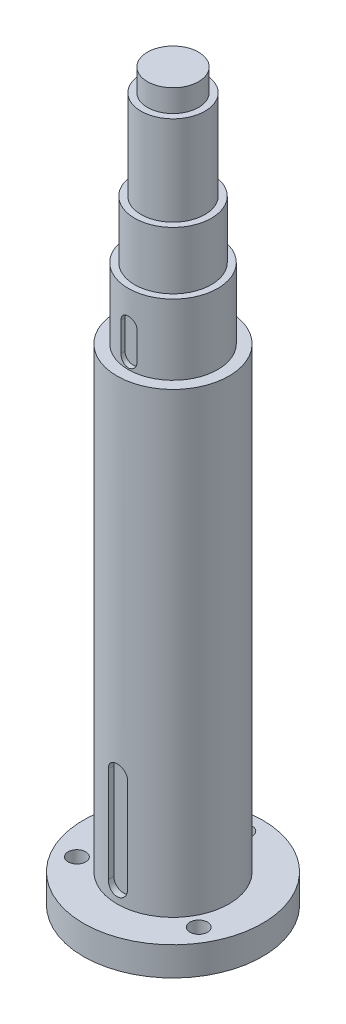
ISO-10303-21;
HEADER;
FILE_DESCRIPTION(('STEP AP214'),'2;1');
FILE_NAME('part.step','',(''),(''),'','','');
FILE_SCHEMA(('AUTOMOTIVE_DESIGN { 1 0 10303 214 1 1 1 1 }'));
ENDSEC;
DATA;
#1=APPLICATION_CONTEXT('core data for automotive mechanical design processes');
#2=APPLICATION_PROTOCOL_DEFINITION('international standard','automotive_design',2000,#1);
#3=PRODUCT_CONTEXT('',#1,'mechanical');
#4=PRODUCT('Part','Part','',(#3));
#5=PRODUCT_RELATED_PRODUCT_CATEGORY('part','',(#4));
#6=PRODUCT_DEFINITION_FORMATION('','',#4);
#7=PRODUCT_DEFINITION_CONTEXT('part definition',#1,'design');
#8=PRODUCT_DEFINITION('design','',#6,#7);
#9=PRODUCT_DEFINITION_SHAPE('','',#8);
#10=(LENGTH_UNIT() NAMED_UNIT(*) SI_UNIT(.MILLI.,.METRE.));
#11=(NAMED_UNIT(*) PLANE_ANGLE_UNIT() SI_UNIT($,.RADIAN.));
#12=(NAMED_UNIT(*) SI_UNIT($,.STERADIAN.) SOLID_ANGLE_UNIT());
#13=UNCERTAINTY_MEASURE_WITH_UNIT(LENGTH_MEASURE(1.E-05),#10,'distance_accuracy_value','');
#14=(GEOMETRIC_REPRESENTATION_CONTEXT(3) GLOBAL_UNCERTAINTY_ASSIGNED_CONTEXT((#13)) GLOBAL_UNIT_ASSIGNED_CONTEXT((#10,
#11,#12)) REPRESENTATION_CONTEXT('',''));
#15=CARTESIAN_POINT('',(0.,0.,0.));
#16=DIRECTION('',(0.,0.,1.));
#17=DIRECTION('',(1.,0.,0.));
#18=AXIS2_PLACEMENT_3D('',#15,#16,#17);
#19=CARTESIAN_POINT('',(19.0525588832577,227.001,10.9999999999998));
#20=DIRECTION('',(0.,-1.,0.));
#21=DIRECTION('',(0.,0.,-1.));
#22=AXIS2_PLACEMENT_3D('',#19,#20,#21);
#23=CYLINDRICAL_SURFACE('',#22,2.75);
#24=CARTESIAN_POINT('',(19.0525588832577,9.00000000000001,10.9999999999998));
#25=DIRECTION('',(0.,-1.,0.));
#26=DIRECTION('',(0.,0.,-1.));
#27=AXIS2_PLACEMENT_3D('',#24,#25,#26);
#28=CIRCLE('',#27,2.75);
#29=CARTESIAN_POINT('',(19.0525588832577,9.00000000000001,8.24999999999982));
#30=VERTEX_POINT('',#29);
#31=EDGE_CURVE('E368',#30,#30,#28,.F.);
#32=ORIENTED_EDGE('',*,*,#31,.T.);
#33=EDGE_LOOP('',(#32));
#34=FACE_BOUND('',#33,.T.);
#35=CARTESIAN_POINT('',(19.0525588832577,5.,10.9999999999998));
#36=DIRECTION('',(0.,-1.,0.));
#37=DIRECTION('',(0.,0.,-1.));
#38=AXIS2_PLACEMENT_3D('',#35,#36,#37);
#39=CIRCLE('',#38,2.75);
#40=CARTESIAN_POINT('',(19.0525588832577,5.,8.24999999999982));
#41=VERTEX_POINT('',#40);
#42=EDGE_CURVE('E38',#41,#41,#39,.F.);
#43=ORIENTED_EDGE('',*,*,#42,.F.);
#44=EDGE_LOOP('',(#43));
#45=FACE_BOUND('',#44,.T.);
#46=ADVANCED_FACE('F34',(#34,#45),#23,.F.);
#47=CARTESIAN_POINT('',(-19.0525588832576,227.001,11.0000000000001));
#48=DIRECTION('',(0.,-1.,0.));
#49=DIRECTION('',(0.,0.,-1.));
#50=AXIS2_PLACEMENT_3D('',#47,#48,#49);
#51=CYLINDRICAL_SURFACE('',#50,2.75);
#52=CARTESIAN_POINT('',(-19.0525588832576,9.00000000000001,11.0000000000001));
#53=DIRECTION('',(0.,-1.,0.));
#54=DIRECTION('',(0.,0.,-1.));
#55=AXIS2_PLACEMENT_3D('',#52,#53,#54);
#56=CIRCLE('',#55,2.75);
#57=CARTESIAN_POINT('',(-19.0525588832576,9.00000000000001,8.25000000000009));
#58=VERTEX_POINT('',#57);
#59=EDGE_CURVE('E364',#58,#58,#56,.F.);
#60=ORIENTED_EDGE('',*,*,#59,.T.);
#61=EDGE_LOOP('',(#60));
#62=FACE_BOUND('',#61,.T.);
#63=CARTESIAN_POINT('',(-19.0525588832576,5.,11.0000000000001));
#64=DIRECTION('',(0.,-1.,0.));
#65=DIRECTION('',(0.,0.,-1.));
#66=AXIS2_PLACEMENT_3D('',#63,#64,#65);
#67=CIRCLE('',#66,2.75);
#68=CARTESIAN_POINT('',(-19.0525588832576,5.,8.25000000000009));
#69=VERTEX_POINT('',#68);
#70=EDGE_CURVE('E372',#69,#69,#67,.F.);
#71=ORIENTED_EDGE('',*,*,#70,.F.);
#72=EDGE_LOOP('',(#71));
#73=FACE_BOUND('',#72,.T.);
#74=ADVANCED_FACE('F285',(#62,#73),#51,.F.);
#75=CARTESIAN_POINT('',(0.,227.001,-22.));
#76=DIRECTION('',(0.,-1.,0.));
#77=DIRECTION('',(0.,0.,-1.));
#78=AXIS2_PLACEMENT_3D('',#75,#76,#77);
#79=CYLINDRICAL_SURFACE('',#78,2.75);
#80=CARTESIAN_POINT('',(0.,9.00000000000001,-22.));
#81=DIRECTION('',(0.,-1.,0.));
#82=DIRECTION('',(0.,0.,-1.));
#83=AXIS2_PLACEMENT_3D('',#80,#81,#82);
#84=CIRCLE('',#83,2.75);
#85=CARTESIAN_POINT('',(0.,9.00000000000001,-24.75));
#86=VERTEX_POINT('',#85);
#87=EDGE_CURVE('E123',#86,#86,#84,.F.);
#88=ORIENTED_EDGE('',*,*,#87,.T.);
#89=EDGE_LOOP('',(#88));
#90=FACE_BOUND('',#89,.T.);
#91=CARTESIAN_POINT('',(0.,5.,-22.));
#92=DIRECTION('',(0.,-1.,0.));
#93=DIRECTION('',(0.,0.,-1.));
#94=AXIS2_PLACEMENT_3D('',#91,#92,#93);
#95=CIRCLE('',#94,2.75);
#96=CARTESIAN_POINT('',(0.,5.,-24.75));
#97=VERTEX_POINT('',#96);
#98=EDGE_CURVE('E126',#97,#97,#95,.F.);
#99=ORIENTED_EDGE('',*,*,#98,.F.);
#100=EDGE_LOOP('',(#99));
#101=FACE_BOUND('',#100,.T.);
#102=ADVANCED_FACE('F291',(#90,#101),#79,.F.);
#103=CARTESIAN_POINT('',(0.,0.,0.));
#104=DIRECTION('',(0.,1.,0.));
#105=DIRECTION('',(0.,0.,1.));
#106=AXIS2_PLACEMENT_3D('',#103,#104,#105);
#107=PLANE('',#106);
#108=CARTESIAN_POINT('',(19.0525588832577,0.,10.9999999999998));
#109=DIRECTION('',(0.,-1.,0.));
#110=DIRECTION('',(0.866025403784443,0.,0.499999999999992));
#111=AXIS2_PLACEMENT_3D('',#108,#109,#110);
#112=CIRCLE('',#111,4.5);
#113=CARTESIAN_POINT('',(22.9496732002877,0.,13.2499999999998));
#114=VERTEX_POINT('',#113);
#115=EDGE_CURVE('E354',#114,#114,#112,.T.);
#116=ORIENTED_EDGE('',*,*,#115,.F.);
#117=EDGE_LOOP('',(#116));
#118=FACE_BOUND('',#117,.T.);
#119=CARTESIAN_POINT('',(-19.0525588832576,0.,11.0000000000001));
#120=DIRECTION('',(0.,-1.,0.));
#121=DIRECTION('',(-0.866025403784436,0.,0.500000000000004));
#122=AXIS2_PLACEMENT_3D('',#119,#120,#121);
#123=CIRCLE('',#122,4.5);
#124=CARTESIAN_POINT('',(-22.9496732002876,0.,13.2500000000001));
#125=VERTEX_POINT('',#124);
#126=EDGE_CURVE('E358',#125,#125,#123,.T.);
#127=ORIENTED_EDGE('',*,*,#126,.F.);
#128=EDGE_LOOP('',(#127));
#129=FACE_BOUND('',#128,.T.);
#130=CARTESIAN_POINT('',(0.,0.,-22.));
#131=DIRECTION('',(0.,-1.,0.));
#132=DIRECTION('',(0.,0.,-1.));
#133=AXIS2_PLACEMENT_3D('',#130,#131,#132);
#134=CIRCLE('',#133,4.5);
#135=CARTESIAN_POINT('',(0.,0.,-26.5));
#136=VERTEX_POINT('',#135);
#137=EDGE_CURVE('E361',#136,#136,#134,.T.);
#138=ORIENTED_EDGE('',*,*,#137,.F.);
#139=EDGE_LOOP('',(#138));
#140=FACE_BOUND('',#139,.T.);
#141=CARTESIAN_POINT('',(0.,0.,0.));
#142=DIRECTION('',(0.,1.,0.));
#143=DIRECTION('',(0.,0.,1.));
#144=AXIS2_PLACEMENT_3D('',#141,#142,#143);
#145=CIRCLE('',#144,28.);
#146=CARTESIAN_POINT('',(0.,0.,28.));
#147=VERTEX_POINT('',#146);
#148=EDGE_CURVE('E193',#147,#147,#145,.T.);
#149=ORIENTED_EDGE('',*,*,#148,.F.);
#150=EDGE_LOOP('',(#149));
#151=FACE_BOUND('',#150,.T.);
#152=ADVANCED_FACE('F36',(#118,#129,#140,#151),#107,.F.);
#153=CARTESIAN_POINT('',(0.,340.077659461417,0.));
#154=DIRECTION('',(0.,1.,0.));
#155=DIRECTION('',(0.,0.,1.));
#156=AXIS2_PLACEMENT_3D('',#153,#154,#155);
#157=CYLINDRICAL_SURFACE('',#156,28.);
#158=CARTESIAN_POINT('',(0.,9.00000000000001,0.));
#159=DIRECTION('',(0.,1.,0.));
#160=DIRECTION('',(0.,0.,1.));
#161=AXIS2_PLACEMENT_3D('',#158,#159,#160);
#162=CIRCLE('',#161,28.);
#163=CARTESIAN_POINT('',(0.,9.00000000000001,28.));
#164=VERTEX_POINT('',#163);
#165=EDGE_CURVE('E190',#164,#164,#162,.T.);
#166=ORIENTED_EDGE('',*,*,#165,.F.);
#167=EDGE_LOOP('',(#166));
#168=FACE_BOUND('',#167,.T.);
#169=ORIENTED_EDGE('',*,*,#148,.T.);
#170=EDGE_LOOP('',(#169));
#171=FACE_BOUND('',#170,.T.);
#172=ADVANCED_FACE('F339',(#168,#171),#157,.T.);
#173=CARTESIAN_POINT('',(28.,9.,0.));
#174=DIRECTION('',(0.,-1.,0.));
#175=DIRECTION('',(0.,0.,-1.));
#176=AXIS2_PLACEMENT_3D('',#173,#174,#175);
#177=PLANE('',#176);
#178=ORIENTED_EDGE('',*,*,#31,.F.);
#179=EDGE_LOOP('',(#178));
#180=FACE_BOUND('',#179,.T.);
#181=ORIENTED_EDGE('',*,*,#59,.F.);
#182=EDGE_LOOP('',(#181));
#183=FACE_BOUND('',#182,.T.);
#184=ORIENTED_EDGE('',*,*,#87,.F.);
#185=EDGE_LOOP('',(#184));
#186=FACE_BOUND('',#185,.T.);
#187=CARTESIAN_POINT('',(0.,9.00000000000001,0.));
#188=DIRECTION('',(0.,1.,0.));
#189=DIRECTION('',(0.,0.,1.));
#190=AXIS2_PLACEMENT_3D('',#187,#188,#189);
#191=CIRCLE('',#190,17.5);
#192=CARTESIAN_POINT('',(0.,9.00000000000001,17.5));
#193=VERTEX_POINT('',#192);
#194=EDGE_CURVE('E187',#193,#193,#191,.T.);
#195=ORIENTED_EDGE('',*,*,#194,.F.);
#196=EDGE_LOOP('',(#195));
#197=FACE_BOUND('',#196,.T.);
#198=ORIENTED_EDGE('',*,*,#165,.T.);
#199=EDGE_LOOP('',(#198));
#200=FACE_BOUND('',#199,.T.);
#201=ADVANCED_FACE('F332',(#180,#183,#186,#197,#200),#177,.F.);
#202=CARTESIAN_POINT('',(0.,340.077659461417,0.));
#203=DIRECTION('',(0.,1.,0.));
#204=DIRECTION('',(0.,0.,1.));
#205=AXIS2_PLACEMENT_3D('',#202,#203,#204);
#206=CYLINDRICAL_SURFACE('',#205,17.5);
#207=DIRECTION('',(0.,1.,0.));
#208=VECTOR('',#207,1.);
#209=CARTESIAN_POINT('',(2.99999999999996,340.077659461417,17.2409396495667));
#210=LINE('',#209,#208);
#211=CARTESIAN_POINT('',(3.,44.,17.2409396495667));
#212=VERTEX_POINT('',#211);
#213=CARTESIAN_POINT('',(3.,14.,17.2409396495667));
#214=VERTEX_POINT('',#213);
#215=EDGE_CURVE('E325',#212,#214,#210,.F.);
#216=ORIENTED_EDGE('',*,*,#215,.T.);
#217=CARTESIAN_POINT('',(3.,14.,17.2409396495667));
#218=CARTESIAN_POINT('',(3.0000088040537,13.9162831483448,17.240933522875));
#219=CARTESIAN_POINT('',(2.99649582804046,13.8325709851479,17.2415492732181));
#220=CARTESIAN_POINT('',(2.98249456452798,13.6657579190101,17.2439791973893));
#221=CARTESIAN_POINT('',(2.97200699674828,13.5826569538933,17.2457932475627));
#222=CARTESIAN_POINT('',(2.94414295173168,13.4177582332087,17.2505713408137));
#223=CARTESIAN_POINT('',(2.92677547561188,13.3359589195389,17.2535338811914));
#224=CARTESIAN_POINT('',(2.88530199450964,13.1741566952482,17.2605176845743));
#225=CARTESIAN_POINT('',(2.86119599181698,13.0941537840168,17.2645389472196));
#226=CARTESIAN_POINT('',(2.77899783708822,12.8576492292287,17.2780294463356));
#227=CARTESIAN_POINT('',(2.71100609527454,12.704537516206,17.2889289407825));
#228=CARTESIAN_POINT('',(2.55069376365582,12.4119724808913,17.3133038570054));
#229=CARTESIAN_POINT('',(2.45837256556576,12.2725195002144,17.326779343184));
#230=CARTESIAN_POINT('',(2.25098410381963,12.0096905954682,17.3549443765962));
#231=CARTESIAN_POINT('',(2.13571500938206,11.8864747212079,17.3696439701141));
#232=CARTESIAN_POINT('',(1.88613300564843,11.6610272667778,17.3985129918921));
#233=CARTESIAN_POINT('',(1.75181717893938,11.5587989071757,17.4126823385127));
#234=CARTESIAN_POINT('',(1.46690914941874,11.3776250961241,17.4390005653397));
#235=CARTESIAN_POINT('',(1.31621959902381,11.2988306159742,17.4511361335045));
#236=CARTESIAN_POINT('',(1.00350915711504,11.1677383960012,17.4719058089544));
#237=CARTESIAN_POINT('',(0.841489687717146,11.1154373375293,17.4805403547613));
#238=CARTESIAN_POINT('',(0.512384825162235,11.039305906677,17.4932645087899));
#239=CARTESIAN_POINT('',(0.345364126893581,11.0152032502798,17.4973975561921));
#240=CARTESIAN_POINT('',(0.00959767163450528,10.9953057761956,17.5008024278457));
#241=CARTESIAN_POINT('',(-0.159148002024918,10.999509597457,17.5000744858265));
#242=CARTESIAN_POINT('',(-0.49170276478881,11.0358951688302,17.4938735057628));
#243=CARTESIAN_POINT('',(-0.655545062925507,11.0677831074717,17.4884503002017));
#244=CARTESIAN_POINT('',(-0.975517346205458,11.1581684499129,17.473523834867));
#245=CARTESIAN_POINT('',(-1.13164713594127,11.2166665275356,17.4640204717758));
#246=CARTESIAN_POINT('',(-1.43263521316219,11.3589020091258,17.441916799726));
#247=CARTESIAN_POINT('',(-1.57743532822014,11.4427601256503,17.429301733358));
#248=CARTESIAN_POINT('',(-1.85101374510969,11.6332438394255,17.4023754724501));
#249=CARTESIAN_POINT('',(-1.97979126157134,11.7398705520155,17.3880641948351));
#250=CARTESIAN_POINT('',(-2.21939638987407,11.9744757576199,17.3591202396607));
#251=CARTESIAN_POINT('',(-2.3299750110891,12.1027084455725,17.3444857890986));
#252=CARTESIAN_POINT('',(-2.52811891278482,12.3760810488902,17.3167162017033));
#253=CARTESIAN_POINT('',(-2.61567766193135,12.5212257458091,17.3035814909819));
#254=CARTESIAN_POINT('',(-2.76535092265273,12.8246206169006,17.2802952650445));
#255=CARTESIAN_POINT('',(-2.82741926032348,12.9828939549107,17.2701491727941));
#256=CARTESIAN_POINT('',(-2.92393010715655,13.3077258419107,17.2540739223703));
#257=CARTESIAN_POINT('',(-2.95841389098171,13.474271614767,17.2481384653514));
#258=CARTESIAN_POINT('',(-2.98573965568073,13.7017439639912,17.2434157056549));
#259=CARTESIAN_POINT('',(-2.99108946982253,13.7613185145031,17.2424880383213));
#260=CARTESIAN_POINT('',(-2.99821500871414,13.8805866549158,17.2412506208778));
#261=CARTESIAN_POINT('',(-2.99999674326831,13.940279874851,17.2409398317527));
#262=CARTESIAN_POINT('',(-3.,14.,17.2409396495667));
#263=B_SPLINE_CURVE_WITH_KNOTS('',3,(#217,#218,#219,#220,#221,#222,#223,#224,#225,#226,#227,
#228,#229,#230,#231,#232,#233,#234,#235,#236,#237,#238,#239,#240,#241,#242,#243,#244,#245,#246,
#247,#248,#249,#250,#251,#252,#253,#254,#255,#256,#257,#258,#259,#260,#261,#262),.UNSPECIFIED.,
.F.,.F.,(4,2,2,2,2,2,2,2,2,2,2,2,2,2,2,2,2,2,2,2,2,2,4),(0.,0.251066363004867,0.502106822079304,
0.752819919097137,1.00353293092177,1.50461549636059,2.0057105910537,2.51142483323933,
3.01721662017684,3.52619966130844,4.03511892986121,4.53908241461735,5.04302166762933,
5.5416771043184,6.04034516868375,6.54142526197249,7.04252990673079,7.55000463252362,
8.05762318703839,8.56615724003014,9.07392894462736,9.25331063398997,9.4323899313747),.UNSPECIFIED.);
#264=CARTESIAN_POINT('',(-3.,14.,17.2409396495667));
#265=VERTEX_POINT('',#264);
#266=EDGE_CURVE('E196',#214,#265,#263,.T.);
#267=ORIENTED_EDGE('',*,*,#266,.T.);
#268=DIRECTION('',(0.,1.,0.));
#269=VECTOR('',#268,1.);
#270=CARTESIAN_POINT('',(-3.00000000000003,340.077659461417,17.2409396495667));
#271=LINE('',#270,#269);
#272=CARTESIAN_POINT('',(-3.00000000000003,44.,17.2409396495667));
#273=VERTEX_POINT('',#272);
#274=EDGE_CURVE('E327',#265,#273,#271,.T.);
#275=ORIENTED_EDGE('',*,*,#274,.T.);
#276=CARTESIAN_POINT('',(-3.,44.,17.2409396495667));
#277=CARTESIAN_POINT('',(-3.0000088040537,44.0837168516552,17.240933522875));
#278=CARTESIAN_POINT('',(-2.99649582804046,44.1674290148521,17.2415492732181));
#279=CARTESIAN_POINT('',(-2.98249456452797,44.3342420809899,17.2439791973893));
#280=CARTESIAN_POINT('',(-2.97200699674828,44.4173430461067,17.2457932475627));
#281=CARTESIAN_POINT('',(-2.94414295173167,44.5822417667913,17.2505713408137));
#282=CARTESIAN_POINT('',(-2.92677547561188,44.6640410804611,17.2535338811914));
#283=CARTESIAN_POINT('',(-2.88530199450964,44.8258433047518,17.2605176845743));
#284=CARTESIAN_POINT('',(-2.86119599181697,44.9058462159832,17.2645389472196));
#285=CARTESIAN_POINT('',(-2.77899783708822,45.1423507707714,17.2780294463356));
#286=CARTESIAN_POINT('',(-2.71100609527453,45.295462483794,17.2889289407825));
#287=CARTESIAN_POINT('',(-2.55069376365582,45.5880275191087,17.3133038570054));
#288=CARTESIAN_POINT('',(-2.45837256556576,45.7274804997856,17.326779343184));
#289=CARTESIAN_POINT('',(-2.25098410381962,45.9903094045318,17.3549443765962));
#290=CARTESIAN_POINT('',(-2.13571500938206,46.1135252787921,17.3696439701141));
#291=CARTESIAN_POINT('',(-1.88613300564842,46.3389727332222,17.3985129918921));
#292=CARTESIAN_POINT('',(-1.75181717893937,46.4412010928243,17.4126823385127));
#293=CARTESIAN_POINT('',(-1.46690914941873,46.6223749038759,17.4390005653397));
#294=CARTESIAN_POINT('',(-1.31621959902381,46.7011693840258,17.4511361335045));
#295=CARTESIAN_POINT('',(-1.00350915711504,46.8322616039989,17.4719058089544));
#296=CARTESIAN_POINT('',(-0.841489687717143,46.8845626624707,17.4805403547613));
#297=CARTESIAN_POINT('',(-0.512384825162232,46.960694093323,17.4932645087899));
#298=CARTESIAN_POINT('',(-0.345364126893578,46.9847967497202,17.4973975561921));
#299=CARTESIAN_POINT('',(-0.00959767163450268,47.0046942238045,17.5008024278457));
#300=CARTESIAN_POINT('',(0.15914800202492,47.000490402543,17.5000744858265));
#301=CARTESIAN_POINT('',(0.491702764788814,46.9641048311698,17.4938735057628));
#302=CARTESIAN_POINT('',(0.655545062925512,46.9322168925283,17.4884503002017));
#303=CARTESIAN_POINT('',(0.975517346205462,46.8418315500871,17.473523834867));
#304=CARTESIAN_POINT('',(1.13164713594127,46.7833334724644,17.4640204717758));
#305=CARTESIAN_POINT('',(1.43263521316219,46.6410979908742,17.441916799726));
#306=CARTESIAN_POINT('',(1.57743532822014,46.5572398743497,17.429301733358));
#307=CARTESIAN_POINT('',(1.85101374510969,46.3667561605745,17.4023754724501));
#308=CARTESIAN_POINT('',(1.97979126157134,46.2601294479845,17.3880641948351));
#309=CARTESIAN_POINT('',(2.21939638987407,46.0255242423801,17.3591202396607));
#310=CARTESIAN_POINT('',(2.32997501108911,45.8972915544275,17.3444857890986));
#311=CARTESIAN_POINT('',(2.52811891278483,45.6239189511098,17.3167162017033));
#312=CARTESIAN_POINT('',(2.61567766193135,45.478774254191,17.3035814909819));
#313=CARTESIAN_POINT('',(2.76535092265273,45.1753793830994,17.2802952650445));
#314=CARTESIAN_POINT('',(2.82741926032348,45.0171060450893,17.2701491727941));
#315=CARTESIAN_POINT('',(2.92393010715655,44.6922741580893,17.2540739223703));
#316=CARTESIAN_POINT('',(2.95841389098172,44.525728385233,17.2481384653514));
#317=CARTESIAN_POINT('',(2.98573965568073,44.2982560360088,17.2434157056549));
#318=CARTESIAN_POINT('',(2.99108946982254,44.2386814854969,17.2424880383213));
#319=CARTESIAN_POINT('',(2.99821500871414,44.1194133450842,17.2412506208778));
#320=CARTESIAN_POINT('',(2.99999674326831,44.059720125149,17.2409398317527));
#321=CARTESIAN_POINT('',(3.,44.,17.2409396495667));
#322=B_SPLINE_CURVE_WITH_KNOTS('',3,(#276,#277,#278,#279,#280,#281,#282,#283,#284,#285,#286,
#287,#288,#289,#290,#291,#292,#293,#294,#295,#296,#297,#298,#299,#300,#301,#302,#303,#304,#305,
#306,#307,#308,#309,#310,#311,#312,#313,#314,#315,#316,#317,#318,#319,#320,#321),.UNSPECIFIED.,
.F.,.F.,(4,2,2,2,2,2,2,2,2,2,2,2,2,2,2,2,2,2,2,2,2,2,4),(0.,0.251066363004874,0.502106822079309,
0.752819919097147,1.00353293092177,1.50461549636058,2.0057105910537,2.51142483323933,
3.01721662017684,3.52619966130844,4.03511892986121,4.53908241461735,5.04302166762933,
5.5416771043184,6.04034516868374,6.54142526197248,7.04252990673078,7.55000463252362,
8.05762318703839,8.56615724003013,9.07392894462736,9.25331063398997,9.43238993137469),.UNSPECIFIED.);
#323=EDGE_CURVE('E59',#273,#212,#322,.T.);
#324=ORIENTED_EDGE('',*,*,#323,.T.);
#325=EDGE_LOOP('',(#216,#267,#275,#324));
#326=FACE_BOUND('',#325,.T.);
#327=CARTESIAN_POINT('',(0.,152.,0.));
#328=DIRECTION('',(0.,1.,0.));
#329=DIRECTION('',(0.,0.,1.));
#330=AXIS2_PLACEMENT_3D('',#327,#328,#329);
#331=CIRCLE('',#330,17.5);
#332=CARTESIAN_POINT('',(0.,152.,17.5));
#333=VERTEX_POINT('',#332);
#334=EDGE_CURVE('E184',#333,#333,#331,.T.);
#335=ORIENTED_EDGE('',*,*,#334,.F.);
#336=EDGE_LOOP('',(#335));
#337=FACE_BOUND('',#336,.T.);
#338=ORIENTED_EDGE('',*,*,#194,.T.);
#339=EDGE_LOOP('',(#338));
#340=FACE_BOUND('',#339,.T.);
#341=ADVANCED_FACE('F209',(#326,#337,#340),#206,.T.);
#342=CARTESIAN_POINT('',(17.5,152.,0.));
#343=DIRECTION('',(0.,-1.,0.));
#344=DIRECTION('',(0.,0.,-1.));
#345=AXIS2_PLACEMENT_3D('',#342,#343,#344);
#346=PLANE('',#345);
#347=CARTESIAN_POINT('',(0.,152.,0.));
#348=DIRECTION('',(0.,1.,0.));
#349=DIRECTION('',(0.,0.,1.));
#350=AXIS2_PLACEMENT_3D('',#347,#348,#349);
#351=CIRCLE('',#350,14.);
#352=CARTESIAN_POINT('',(0.,152.,14.));
#353=VERTEX_POINT('',#352);
#354=EDGE_CURVE('E181',#353,#353,#351,.T.);
#355=ORIENTED_EDGE('',*,*,#354,.F.);
#356=EDGE_LOOP('',(#355));
#357=FACE_BOUND('',#356,.T.);
#358=ORIENTED_EDGE('',*,*,#334,.T.);
#359=EDGE_LOOP('',(#358));
#360=FACE_BOUND('',#359,.T.);
#361=ADVANCED_FACE('F260',(#357,#360),#346,.F.);
#362=CARTESIAN_POINT('',(0.,340.077659461417,0.));
#363=DIRECTION('',(0.,1.,0.));
#364=DIRECTION('',(0.,0.,1.));
#365=AXIS2_PLACEMENT_3D('',#362,#363,#364);
#366=CYLINDRICAL_SURFACE('',#365,14.);
#367=DIRECTION('',(0.,1.,0.));
#368=VECTOR('',#367,1.);
#369=CARTESIAN_POINT('',(2.49999999999997,340.077659461417,13.7749773139559));
#370=LINE('',#369,#368);
#371=CARTESIAN_POINT('',(2.5,164.,13.7749773139559));
#372=VERTEX_POINT('',#371);
#373=CARTESIAN_POINT('',(2.5,155.,13.7749773139559));
#374=VERTEX_POINT('',#373);
#375=EDGE_CURVE('E11',#372,#374,#370,.F.);
#376=ORIENTED_EDGE('',*,*,#375,.T.);
#377=CARTESIAN_POINT('',(2.5,155.,13.7749773139559));
#378=CARTESIAN_POINT('',(2.50000738764013,154.930283023611,13.7749719809296));
#379=CARTESIAN_POINT('',(2.49708379952609,154.860570016372,13.7755064686126));
#380=CARTESIAN_POINT('',(2.48543194862783,154.721653941384,13.7776156199531));
#381=CARTESIAN_POINT('',(2.47670431268211,154.652450819382,13.7791901712834));
#382=CARTESIAN_POINT('',(2.45351733904257,154.515134336269,13.7833371889652));
#383=CARTESIAN_POINT('',(2.43906578343079,154.447019625653,13.7859083003202));
#384=CARTESIAN_POINT('',(2.40455678108637,154.312286837445,13.7919690736665));
#385=CARTESIAN_POINT('',(2.38449933046213,154.245668760892,13.7954587362955));
#386=CARTESIAN_POINT('',(2.31610983938097,154.048736131666,13.8071650611379));
#387=CARTESIAN_POINT('',(2.25954393551425,153.921244853428,13.8166222423246));
#388=CARTESIAN_POINT('',(2.12617940892792,153.677624007121,13.8377703697602));
#389=CARTESIAN_POINT('',(2.04937990424302,153.561494934624,13.8494614133751));
#390=CARTESIAN_POINT('',(1.87679372046629,153.342513732668,13.8739070876189));
#391=CARTESIAN_POINT('',(1.78082476766975,153.239806058771,13.8866711889081));
#392=CARTESIAN_POINT('',(1.57301299683331,153.051855735037,13.9117419356394));
#393=CARTESIAN_POINT('',(1.46116774233884,152.966615770797,13.9240485105008));
#394=CARTESIAN_POINT('',(1.22383013818608,152.815471564361,13.9469182244891));
#395=CARTESIAN_POINT('',(1.09824933464102,152.749704142848,13.9574688089978));
#396=CARTESIAN_POINT('',(0.837609153747314,152.640257688769,13.9755305273601));
#397=CARTESIAN_POINT('',(0.702551016579654,152.596575772262,13.9830420580298));
#398=CARTESIAN_POINT('',(0.428295296415088,152.532983914009,13.9941127098686));
#399=CARTESIAN_POINT('',(0.289156409172728,152.512828065034,13.9977126887221));
#400=CARTESIAN_POINT('',(0.00942505741936004,152.496094986239,14.0006952858165));
#401=CARTESIAN_POINT('',(-0.131167328171351,152.499516482889,14.0000781318459));
#402=CARTESIAN_POINT('',(-0.408123452124993,152.529651803756,13.9947279528213));
#403=CARTESIAN_POINT('',(-0.544517097478197,152.556100292534,13.9900418154943));
#404=CARTESIAN_POINT('',(-0.810897887359578,152.631119822722,13.9771326971639));
#405=CARTESIAN_POINT('',(-0.940884857615081,152.679691465553,13.9689096200086));
#406=CARTESIAN_POINT('',(-1.19154374905277,152.79783700102,13.9497713810402));
#407=CARTESIAN_POINT('',(-1.31216373358648,152.867518760359,13.9388424467598));
#408=CARTESIAN_POINT('',(-1.54009397675932,153.02582494113,13.9155041793278));
#409=CARTESIAN_POINT('',(-1.64740347531981,153.114450443535,13.9030947617144));
#410=CARTESIAN_POINT('',(-1.84722881157461,153.309581318558,13.8779697900194));
#411=CARTESIAN_POINT('',(-1.93952008048691,153.416316538369,13.8652523744635));
#412=CARTESIAN_POINT('',(-2.10494815362711,153.643908521011,13.8411056813571));
#413=CARTESIAN_POINT('',(-2.1780795578111,153.764769251146,13.8296767674756));
#414=CARTESIAN_POINT('',(-2.30316821861359,154.017479975145,13.8093973568178));
#415=CARTESIAN_POINT('',(-2.35508301250252,154.149351376924,13.8005520408213));
#416=CARTESIAN_POINT('',(-2.43588597096069,154.420048624112,13.7865213108275));
#417=CARTESIAN_POINT('',(-2.4648085062432,154.558863757993,13.7813304352073));
#418=CARTESIAN_POINT('',(-2.48787628027008,154.748960989519,13.7771728371923));
#419=CARTESIAN_POINT('',(-2.49242446974386,154.79910168616,13.7763503067211));
#420=CARTESIAN_POINT('',(-2.49848241912307,154.899487534708,13.7752530670693));
#421=CARTESIAN_POINT('',(-2.49999728545632,154.949732368286,13.7749774372196));
#422=CARTESIAN_POINT('',(-2.5,155.,13.7749773139559));
#423=B_SPLINE_CURVE_WITH_KNOTS('',3,(#377,#378,#379,#380,#381,#382,#383,#384,#385,#386,#387,
#388,#389,#390,#391,#392,#393,#394,#395,#396,#397,#398,#399,#400,#401,#402,#403,#404,#405,#406,
#407,#408,#409,#410,#411,#412,#413,#414,#415,#416,#417,#418,#419,#420,#421,#422),.UNSPECIFIED.,
.F.,.F.,(4,2,2,2,2,2,2,2,2,2,2,2,2,2,2,2,2,2,2,2,2,2,4),(0.,0.209080632365478,0.418138687640894,
0.626913483707525,0.835688424705487,1.25294270731084,1.67021518068187,2.09166233739033,
2.51317424149735,2.93758113507461,3.36193259498486,3.78180761495385,4.20165995555481,
4.61673750871168,5.03182634647342,5.44907300587891,5.8663434806745,6.28937182366546,
6.71251926562593,7.13650949186791,7.55986470459479,7.71085292872882,7.86158675831534),.UNSPECIFIED.);
#424=CARTESIAN_POINT('',(-2.5,155.,13.7749773139559));
#425=VERTEX_POINT('',#424);
#426=EDGE_CURVE('E264',#374,#425,#423,.T.);
#427=ORIENTED_EDGE('',*,*,#426,.T.);
#428=DIRECTION('',(0.,1.,0.));
#429=VECTOR('',#428,1.);
#430=CARTESIAN_POINT('',(-2.50000000000005,340.077659461417,13.7749773139559));
#431=LINE('',#430,#429);
#432=CARTESIAN_POINT('',(-2.50000000000005,164.,13.7749773139559));
#433=VERTEX_POINT('',#432);
#434=EDGE_CURVE('E43',#425,#433,#431,.T.);
#435=ORIENTED_EDGE('',*,*,#434,.T.);
#436=CARTESIAN_POINT('',(-2.5,164.,13.7749773139559));
#437=CARTESIAN_POINT('',(-2.50000738764013,164.069716976389,13.7749719809296));
#438=CARTESIAN_POINT('',(-2.49708379952609,164.139429983628,13.7755064686126));
#439=CARTESIAN_POINT('',(-2.48543194862783,164.278346058616,13.7776156199531));
#440=CARTESIAN_POINT('',(-2.47670431268211,164.347549180618,13.7791901712834));
#441=CARTESIAN_POINT('',(-2.45351733904256,164.484865663731,13.7833371889652));
#442=CARTESIAN_POINT('',(-2.43906578343079,164.552980374347,13.7859083003202));
#443=CARTESIAN_POINT('',(-2.40455678108637,164.687713162555,13.7919690736665));
#444=CARTESIAN_POINT('',(-2.38449933046213,164.754331239108,13.7954587362955));
#445=CARTESIAN_POINT('',(-2.31610983938097,164.951263868334,13.8071650611379));
#446=CARTESIAN_POINT('',(-2.25954393551425,165.078755146572,13.8166222423246));
#447=CARTESIAN_POINT('',(-2.12617940892792,165.322375992879,13.8377703697602));
#448=CARTESIAN_POINT('',(-2.04937990424302,165.438505065376,13.8494614133751));
#449=CARTESIAN_POINT('',(-1.87679372046629,165.657486267332,13.8739070876189));
#450=CARTESIAN_POINT('',(-1.78082476766975,165.760193941229,13.8866711889081));
#451=CARTESIAN_POINT('',(-1.57301299683331,165.948144264963,13.9117419356394));
#452=CARTESIAN_POINT('',(-1.46116774233884,166.033384229203,13.9240485105008));
#453=CARTESIAN_POINT('',(-1.22383013818608,166.184528435639,13.9469182244891));
#454=CARTESIAN_POINT('',(-1.09824933464103,166.250295857152,13.9574688089978));
#455=CARTESIAN_POINT('',(-0.837609153747321,166.359742311231,13.9755305273601));
#456=CARTESIAN_POINT('',(-0.702551016579657,166.403424227738,13.9830420580298));
#457=CARTESIAN_POINT('',(-0.428295296415087,166.467016085991,13.9941127098686));
#458=CARTESIAN_POINT('',(-0.289156409172727,166.487171934966,13.9977126887221));
#459=CARTESIAN_POINT('',(-0.00942505741935928,166.503905013761,14.0006952858165));
#460=CARTESIAN_POINT('',(0.131167328171352,166.500483517111,14.0000781318459));
#461=CARTESIAN_POINT('',(0.408123452124994,166.470348196244,13.9947279528213));
#462=CARTESIAN_POINT('',(0.544517097478198,166.443899707466,13.9900418154943));
#463=CARTESIAN_POINT('',(0.810897887359579,166.368880177278,13.9771326971639));
#464=CARTESIAN_POINT('',(0.940884857615082,166.320308534447,13.9689096200086));
#465=CARTESIAN_POINT('',(1.19154374905277,166.20216299898,13.9497713810402));
#466=CARTESIAN_POINT('',(1.31216373358648,166.132481239641,13.9388424467598));
#467=CARTESIAN_POINT('',(1.54009397675933,165.97417505887,13.9155041793278));
#468=CARTESIAN_POINT('',(1.64740347531982,165.885549556465,13.9030947617144));
#469=CARTESIAN_POINT('',(1.84722881157461,165.690418681442,13.8779697900194));
#470=CARTESIAN_POINT('',(1.93952008048691,165.583683461631,13.8652523744635));
#471=CARTESIAN_POINT('',(2.10494815362711,165.356091478989,13.8411056813571));
#472=CARTESIAN_POINT('',(2.1780795578111,165.235230748854,13.8296767674756));
#473=CARTESIAN_POINT('',(2.30316821861359,164.982520024855,13.8093973568178));
#474=CARTESIAN_POINT('',(2.35508301250252,164.850648623076,13.8005520408213));
#475=CARTESIAN_POINT('',(2.43588597096069,164.579951375888,13.7865213108275));
#476=CARTESIAN_POINT('',(2.46480850624321,164.441136242007,13.7813304352073));
#477=CARTESIAN_POINT('',(2.48787628027009,164.251039010481,13.7771728371923));
#478=CARTESIAN_POINT('',(2.49242446974386,164.20089831384,13.7763503067211));
#479=CARTESIAN_POINT('',(2.49848241912307,164.100512465292,13.7752530670693));
#480=CARTESIAN_POINT('',(2.49999728545632,164.050267631714,13.7749774372196));
#481=CARTESIAN_POINT('',(2.5,164.,13.7749773139559));
#482=B_SPLINE_CURVE_WITH_KNOTS('',3,(#436,#437,#438,#439,#440,#441,#442,#443,#444,#445,#446,
#447,#448,#449,#450,#451,#452,#453,#454,#455,#456,#457,#458,#459,#460,#461,#462,#463,#464,#465,
#466,#467,#468,#469,#470,#471,#472,#473,#474,#475,#476,#477,#478,#479,#480,#481),.UNSPECIFIED.,
.F.,.F.,(4,2,2,2,2,2,2,2,2,2,2,2,2,2,2,2,2,2,2,2,2,2,4),(0.,0.209080632365478,0.418138687640894,
0.626913483707525,0.835688424705488,1.25294270731084,1.67021518068187,2.09166233739033,
2.51317424149735,2.9375811350746,3.36193259498486,3.78180761495385,4.20165995555481,
4.61673750871168,5.03182634647342,5.44907300587892,5.86634348067451,6.28937182366546,
6.71251926562593,7.13650949186791,7.55986470459479,7.71085292872882,7.86158675831534),.UNSPECIFIED.);
#483=EDGE_CURVE('E51',#433,#372,#482,.T.);
#484=ORIENTED_EDGE('',*,*,#483,.T.);
#485=EDGE_LOOP('',(#376,#427,#435,#484));
#486=FACE_BOUND('',#485,.T.);
#487=CARTESIAN_POINT('',(0.,174.,0.));
#488=DIRECTION('',(0.,1.,0.));
#489=DIRECTION('',(0.,0.,1.));
#490=AXIS2_PLACEMENT_3D('',#487,#488,#489);
#491=CIRCLE('',#490,14.);
#492=CARTESIAN_POINT('',(0.,174.,14.));
#493=VERTEX_POINT('',#492);
#494=EDGE_CURVE('E178',#493,#493,#491,.T.);
#495=ORIENTED_EDGE('',*,*,#494,.F.);
#496=EDGE_LOOP('',(#495));
#497=FACE_BOUND('',#496,.T.);
#498=ORIENTED_EDGE('',*,*,#354,.T.);
#499=EDGE_LOOP('',(#498));
#500=FACE_BOUND('',#499,.T.);
#501=ADVANCED_FACE('F256',(#486,#497,#500),#366,.T.);
#502=CARTESIAN_POINT('',(14.,174.,0.));
#503=DIRECTION('',(0.,-1.,0.));
#504=DIRECTION('',(0.,0.,-1.));
#505=AXIS2_PLACEMENT_3D('',#502,#503,#504);
#506=PLANE('',#505);
#507=CARTESIAN_POINT('',(0.,174.,0.));
#508=DIRECTION('',(0.,1.,0.));
#509=DIRECTION('',(0.,0.,1.));
#510=AXIS2_PLACEMENT_3D('',#507,#508,#509);
#511=CIRCLE('',#510,12.);
#512=CARTESIAN_POINT('',(0.,174.,12.));
#513=VERTEX_POINT('',#512);
#514=EDGE_CURVE('E175',#513,#513,#511,.T.);
#515=ORIENTED_EDGE('',*,*,#514,.F.);
#516=EDGE_LOOP('',(#515));
#517=FACE_BOUND('',#516,.T.);
#518=ORIENTED_EDGE('',*,*,#494,.T.);
#519=EDGE_LOOP('',(#518));
#520=FACE_BOUND('',#519,.T.);
#521=ADVANCED_FACE('F252',(#517,#520),#506,.F.);
#522=CARTESIAN_POINT('',(0.,340.077659461417,0.));
#523=DIRECTION('',(0.,1.,0.));
#524=DIRECTION('',(0.,0.,1.));
#525=AXIS2_PLACEMENT_3D('',#522,#523,#524);
#526=CYLINDRICAL_SURFACE('',#525,12.);
#527=CARTESIAN_POINT('',(0.,192.,0.));
#528=DIRECTION('',(0.,1.,0.));
#529=DIRECTION('',(0.,0.,1.));
#530=AXIS2_PLACEMENT_3D('',#527,#528,#529);
#531=CIRCLE('',#530,12.);
#532=CARTESIAN_POINT('',(0.,192.,12.));
#533=VERTEX_POINT('',#532);
#534=EDGE_CURVE('E172',#533,#533,#531,.T.);
#535=ORIENTED_EDGE('',*,*,#534,.F.);
#536=EDGE_LOOP('',(#535));
#537=FACE_BOUND('',#536,.T.);
#538=ORIENTED_EDGE('',*,*,#514,.T.);
#539=EDGE_LOOP('',(#538));
#540=FACE_BOUND('',#539,.T.);
#541=ADVANCED_FACE('F248',(#537,#540),#526,.T.);
#542=CARTESIAN_POINT('',(12.,192.,0.));
#543=DIRECTION('',(0.,-1.,0.));
#544=DIRECTION('',(0.,0.,-1.));
#545=AXIS2_PLACEMENT_3D('',#542,#543,#544);
#546=PLANE('',#545);
#547=CARTESIAN_POINT('',(0.,192.,0.));
#548=DIRECTION('',(0.,1.,0.));
#549=DIRECTION('',(0.,0.,1.));
#550=AXIS2_PLACEMENT_3D('',#547,#548,#549);
#551=CIRCLE('',#550,10.);
#552=CARTESIAN_POINT('',(0.,192.,10.));
#553=VERTEX_POINT('',#552);
#554=EDGE_CURVE('E169',#553,#553,#551,.T.);
#555=ORIENTED_EDGE('',*,*,#554,.F.);
#556=EDGE_LOOP('',(#555));
#557=FACE_BOUND('',#556,.T.);
#558=ORIENTED_EDGE('',*,*,#534,.T.);
#559=EDGE_LOOP('',(#558));
#560=FACE_BOUND('',#559,.T.);
#561=ADVANCED_FACE('F244',(#557,#560),#546,.F.);
#562=CARTESIAN_POINT('',(0.,340.077659461417,0.));
#563=DIRECTION('',(0.,1.,0.));
#564=DIRECTION('',(0.,0.,1.));
#565=AXIS2_PLACEMENT_3D('',#562,#563,#564);
#566=CYLINDRICAL_SURFACE('',#565,10.);
#567=CARTESIAN_POINT('',(0.,220.,0.));
#568=DIRECTION('',(0.,1.,0.));
#569=DIRECTION('',(0.,0.,1.));
#570=AXIS2_PLACEMENT_3D('',#567,#568,#569);
#571=CIRCLE('',#570,10.);
#572=CARTESIAN_POINT('',(0.,220.,10.));
#573=VERTEX_POINT('',#572);
#574=EDGE_CURVE('E166',#573,#573,#571,.T.);
#575=ORIENTED_EDGE('',*,*,#574,.F.);
#576=EDGE_LOOP('',(#575));
#577=FACE_BOUND('',#576,.T.);
#578=ORIENTED_EDGE('',*,*,#554,.T.);
#579=EDGE_LOOP('',(#578));
#580=FACE_BOUND('',#579,.T.);
#581=ADVANCED_FACE('F240',(#577,#580),#566,.T.);
#582=CARTESIAN_POINT('',(10.,220.,0.));
#583=DIRECTION('',(0.,-1.,0.));
#584=DIRECTION('',(0.,0.,-1.));
#585=AXIS2_PLACEMENT_3D('',#582,#583,#584);
#586=PLANE('',#585);
#587=CARTESIAN_POINT('',(0.,220.,0.));
#588=DIRECTION('',(0.,1.,0.));
#589=DIRECTION('',(0.,0.,1.));
#590=AXIS2_PLACEMENT_3D('',#587,#588,#589);
#591=CIRCLE('',#590,8.);
#592=CARTESIAN_POINT('',(0.,220.,8.));
#593=VERTEX_POINT('',#592);
#594=EDGE_CURVE('E163',#593,#593,#591,.T.);
#595=ORIENTED_EDGE('',*,*,#594,.F.);
#596=EDGE_LOOP('',(#595));
#597=FACE_BOUND('',#596,.T.);
#598=ORIENTED_EDGE('',*,*,#574,.T.);
#599=EDGE_LOOP('',(#598));
#600=FACE_BOUND('',#599,.T.);
#601=ADVANCED_FACE('F236',(#597,#600),#586,.F.);
#602=CARTESIAN_POINT('',(0.,340.077659461417,0.));
#603=DIRECTION('',(0.,1.,0.));
#604=DIRECTION('',(0.,0.,1.));
#605=AXIS2_PLACEMENT_3D('',#602,#603,#604);
#606=CYLINDRICAL_SURFACE('',#605,8.);
#607=CARTESIAN_POINT('',(0.,227.,0.));
#608=DIRECTION('',(0.,1.,0.));
#609=DIRECTION('',(0.,0.,1.));
#610=AXIS2_PLACEMENT_3D('',#607,#608,#609);
#611=CIRCLE('',#610,8.);
#612=CARTESIAN_POINT('',(0.,227.,8.));
#613=VERTEX_POINT('',#612);
#614=EDGE_CURVE('E153',#613,#613,#611,.T.);
#615=ORIENTED_EDGE('',*,*,#614,.F.);
#616=EDGE_LOOP('',(#615));
#617=FACE_BOUND('',#616,.T.);
#618=ORIENTED_EDGE('',*,*,#594,.T.);
#619=EDGE_LOOP('',(#618));
#620=FACE_BOUND('',#619,.T.);
#621=ADVANCED_FACE('F232',(#617,#620),#606,.T.);
#622=CARTESIAN_POINT('',(8.,227.,0.));
#623=DIRECTION('',(0.,-1.,0.));
#624=DIRECTION('',(0.,0.,-1.));
#625=AXIS2_PLACEMENT_3D('',#622,#623,#624);
#626=PLANE('',#625);
#627=ORIENTED_EDGE('',*,*,#614,.T.);
#628=EDGE_LOOP('',(#627));
#629=FACE_BOUND('',#628,.T.);
#630=ADVANCED_FACE('F229',(#629),#626,.F.);
#631=CARTESIAN_POINT('',(0.,44.,15.5));
#632=DIRECTION('',(0.,0.,1.));
#633=DIRECTION('',(1.,0.,0.));
#634=AXIS2_PLACEMENT_3D('',#631,#632,#633);
#635=CYLINDRICAL_SURFACE('',#634,3.);
#636=DIRECTION('',(0.,0.,1.));
#637=VECTOR('',#636,1.);
#638=CARTESIAN_POINT('',(-3.,44.,15.5));
#639=LINE('',#638,#637);
#640=CARTESIAN_POINT('',(-3.,44.,15.5));
#641=VERTEX_POINT('',#640);
#642=EDGE_CURVE('E150',#641,#273,#639,.T.);
#643=ORIENTED_EDGE('',*,*,#642,.F.);
#644=CARTESIAN_POINT('',(0.,44.,15.5));
#645=DIRECTION('',(0.,0.,1.));
#646=DIRECTION('',(1.,0.,0.));
#647=AXIS2_PLACEMENT_3D('',#644,#645,#646);
#648=CIRCLE('',#647,3.);
#649=CARTESIAN_POINT('',(3.,44.,15.5));
#650=VERTEX_POINT('',#649);
#651=EDGE_CURVE('E134',#650,#641,#648,.T.);
#652=ORIENTED_EDGE('',*,*,#651,.F.);
#653=DIRECTION('',(0.,0.,1.));
#654=VECTOR('',#653,1.);
#655=CARTESIAN_POINT('',(3.,44.,15.5));
#656=LINE('',#655,#654);
#657=EDGE_CURVE('E151',#650,#212,#656,.T.);
#658=ORIENTED_EDGE('',*,*,#657,.T.);
#659=ORIENTED_EDGE('',*,*,#323,.F.);
#660=EDGE_LOOP('',(#643,#652,#658,#659));
#661=FACE_BOUND('',#660,.T.);
#662=ADVANCED_FACE('F225',(#661),#635,.F.);
#663=CARTESIAN_POINT('',(3.,44.,15.5));
#664=DIRECTION('',(1.,0.,0.));
#665=DIRECTION('',(0.,1.,0.));
#666=AXIS2_PLACEMENT_3D('',#663,#664,#665);
#667=PLANE('',#666);
#668=ORIENTED_EDGE('',*,*,#657,.F.);
#669=DIRECTION('',(0.,1.,0.));
#670=VECTOR('',#669,1.);
#671=CARTESIAN_POINT('',(3.,44.,15.5));
#672=LINE('',#671,#670);
#673=CARTESIAN_POINT('',(3.,14.,15.5));
#674=VERTEX_POINT('',#673);
#675=EDGE_CURVE('E147',#674,#650,#672,.T.);
#676=ORIENTED_EDGE('',*,*,#675,.F.);
#677=DIRECTION('',(0.,0.,1.));
#678=VECTOR('',#677,1.);
#679=CARTESIAN_POINT('',(3.,14.,15.5));
#680=LINE('',#679,#678);
#681=EDGE_CURVE('E154',#674,#214,#680,.T.);
#682=ORIENTED_EDGE('',*,*,#681,.T.);
#683=ORIENTED_EDGE('',*,*,#215,.F.);
#684=EDGE_LOOP('',(#668,#676,#682,#683));
#685=FACE_BOUND('',#684,.T.);
#686=ADVANCED_FACE('F219',(#685),#667,.F.);
#687=CARTESIAN_POINT('',(0.,14.,15.5));
#688=DIRECTION('',(0.,0.,1.));
#689=DIRECTION('',(1.,0.,0.));
#690=AXIS2_PLACEMENT_3D('',#687,#688,#689);
#691=CYLINDRICAL_SURFACE('',#690,3.);
#692=ORIENTED_EDGE('',*,*,#681,.F.);
#693=CARTESIAN_POINT('',(0.,14.,15.5));
#694=DIRECTION('',(0.,0.,1.));
#695=DIRECTION('',(1.,0.,0.));
#696=AXIS2_PLACEMENT_3D('',#693,#694,#695);
#697=CIRCLE('',#696,3.);
#698=CARTESIAN_POINT('',(-3.,14.,15.5));
#699=VERTEX_POINT('',#698);
#700=EDGE_CURVE('E144',#699,#674,#697,.T.);
#701=ORIENTED_EDGE('',*,*,#700,.F.);
#702=DIRECTION('',(0.,0.,1.));
#703=VECTOR('',#702,1.);
#704=CARTESIAN_POINT('',(-3.,14.,15.5));
#705=LINE('',#704,#703);
#706=EDGE_CURVE('E157',#699,#265,#705,.T.);
#707=ORIENTED_EDGE('',*,*,#706,.T.);
#708=ORIENTED_EDGE('',*,*,#266,.F.);
#709=EDGE_LOOP('',(#692,#701,#707,#708));
#710=FACE_BOUND('',#709,.T.);
#711=ADVANCED_FACE('F213',(#710),#691,.F.);
#712=CARTESIAN_POINT('',(-3.,44.,15.5));
#713=DIRECTION('',(-1.,0.,0.));
#714=DIRECTION('',(0.,-1.,0.));
#715=AXIS2_PLACEMENT_3D('',#712,#713,#714);
#716=PLANE('',#715);
#717=ORIENTED_EDGE('',*,*,#706,.F.);
#718=DIRECTION('',(0.,-1.,0.));
#719=VECTOR('',#718,1.);
#720=CARTESIAN_POINT('',(-3.,44.,15.5));
#721=LINE('',#720,#719);
#722=EDGE_CURVE('E141',#641,#699,#721,.T.);
#723=ORIENTED_EDGE('',*,*,#722,.F.);
#724=ORIENTED_EDGE('',*,*,#642,.T.);
#725=ORIENTED_EDGE('',*,*,#274,.F.);
#726=EDGE_LOOP('',(#717,#723,#724,#725));
#727=FACE_BOUND('',#726,.T.);
#728=ADVANCED_FACE('F218',(#727),#716,.F.);
#729=CARTESIAN_POINT('',(0.,44.,15.5));
#730=DIRECTION('',(0.,0.,1.));
#731=DIRECTION('',(1.,0.,0.));
#732=AXIS2_PLACEMENT_3D('',#729,#730,#731);
#733=PLANE('',#732);
#734=ORIENTED_EDGE('',*,*,#651,.T.);
#735=ORIENTED_EDGE('',*,*,#722,.T.);
#736=ORIENTED_EDGE('',*,*,#700,.T.);
#737=ORIENTED_EDGE('',*,*,#675,.T.);
#738=EDGE_LOOP('',(#734,#735,#736,#737));
#739=FACE_BOUND('',#738,.T.);
#740=ADVANCED_FACE('F223',(#739),#733,.T.);
#741=CARTESIAN_POINT('',(0.,164.,12.5));
#742=DIRECTION('',(0.,0.,1.));
#743=DIRECTION('',(1.,0.,0.));
#744=AXIS2_PLACEMENT_3D('',#741,#742,#743);
#745=CYLINDRICAL_SURFACE('',#744,2.5);
#746=DIRECTION('',(0.,0.,1.));
#747=VECTOR('',#746,1.);
#748=CARTESIAN_POINT('',(-2.5,164.,12.5));
#749=LINE('',#748,#747);
#750=CARTESIAN_POINT('',(-2.5,164.,12.5));
#751=VERTEX_POINT('',#750);
#752=EDGE_CURVE('E101',#751,#433,#749,.T.);
#753=ORIENTED_EDGE('',*,*,#752,.F.);
#754=CARTESIAN_POINT('',(0.,164.,12.5));
#755=DIRECTION('',(0.,0.,1.));
#756=DIRECTION('',(1.,0.,0.));
#757=AXIS2_PLACEMENT_3D('',#754,#755,#756);
#758=CIRCLE('',#757,2.5);
#759=CARTESIAN_POINT('',(2.5,164.,12.5));
#760=VERTEX_POINT('',#759);
#761=EDGE_CURVE('E105',#760,#751,#758,.T.);
#762=ORIENTED_EDGE('',*,*,#761,.F.);
#763=DIRECTION('',(0.,0.,1.));
#764=VECTOR('',#763,1.);
#765=CARTESIAN_POINT('',(2.5,164.,12.5));
#766=LINE('',#765,#764);
#767=EDGE_CURVE('E132',#760,#372,#766,.T.);
#768=ORIENTED_EDGE('',*,*,#767,.T.);
#769=ORIENTED_EDGE('',*,*,#483,.F.);
#770=EDGE_LOOP('',(#753,#762,#768,#769));
#771=FACE_BOUND('',#770,.T.);
#772=ADVANCED_FACE('F103',(#771),#745,.F.);
#773=CARTESIAN_POINT('',(2.5,164.,12.5));
#774=DIRECTION('',(1.,0.,0.));
#775=DIRECTION('',(0.,1.,0.));
#776=AXIS2_PLACEMENT_3D('',#773,#774,#775);
#777=PLANE('',#776);
#778=ORIENTED_EDGE('',*,*,#767,.F.);
#779=DIRECTION('',(0.,1.,0.));
#780=VECTOR('',#779,1.);
#781=CARTESIAN_POINT('',(2.5,164.,12.5));
#782=LINE('',#781,#780);
#783=CARTESIAN_POINT('',(2.5,155.,12.5));
#784=VERTEX_POINT('',#783);
#785=EDGE_CURVE('E110',#784,#760,#782,.T.);
#786=ORIENTED_EDGE('',*,*,#785,.F.);
#787=DIRECTION('',(0.,0.,1.));
#788=VECTOR('',#787,1.);
#789=CARTESIAN_POINT('',(2.5,155.,12.5));
#790=LINE('',#789,#788);
#791=EDGE_CURVE('E135',#784,#374,#790,.T.);
#792=ORIENTED_EDGE('',*,*,#791,.T.);
#793=ORIENTED_EDGE('',*,*,#375,.F.);
#794=EDGE_LOOP('',(#778,#786,#792,#793));
#795=FACE_BOUND('',#794,.T.);
#796=ADVANCED_FACE('F279',(#795),#777,.F.);
#797=CARTESIAN_POINT('',(0.,155.,12.5));
#798=DIRECTION('',(0.,0.,1.));
#799=DIRECTION('',(1.,0.,0.));
#800=AXIS2_PLACEMENT_3D('',#797,#798,#799);
#801=CYLINDRICAL_SURFACE('',#800,2.5);
#802=ORIENTED_EDGE('',*,*,#791,.F.);
#803=CARTESIAN_POINT('',(0.,155.,12.5));
#804=DIRECTION('',(0.,0.,1.));
#805=DIRECTION('',(1.,0.,0.));
#806=AXIS2_PLACEMENT_3D('',#803,#804,#805);
#807=CIRCLE('',#806,2.5);
#808=CARTESIAN_POINT('',(-2.5,155.,12.5));
#809=VERTEX_POINT('',#808);
#810=EDGE_CURVE('E119',#809,#784,#807,.T.);
#811=ORIENTED_EDGE('',*,*,#810,.F.);
#812=DIRECTION('',(0.,0.,1.));
#813=VECTOR('',#812,1.);
#814=CARTESIAN_POINT('',(-2.5,155.,12.5));
#815=LINE('',#814,#813);
#816=EDGE_CURVE('E109',#809,#425,#815,.T.);
#817=ORIENTED_EDGE('',*,*,#816,.T.);
#818=ORIENTED_EDGE('',*,*,#426,.F.);
#819=EDGE_LOOP('',(#802,#811,#817,#818));
#820=FACE_BOUND('',#819,.T.);
#821=ADVANCED_FACE('F315',(#820),#801,.F.);
#822=CARTESIAN_POINT('',(-2.5,164.,12.5));
#823=DIRECTION('',(-1.,0.,0.));
#824=DIRECTION('',(0.,-1.,0.));
#825=AXIS2_PLACEMENT_3D('',#822,#823,#824);
#826=PLANE('',#825);
#827=ORIENTED_EDGE('',*,*,#816,.F.);
#828=DIRECTION('',(0.,-1.,0.));
#829=VECTOR('',#828,1.);
#830=CARTESIAN_POINT('',(-2.5,164.,12.5));
#831=LINE('',#830,#829);
#832=EDGE_CURVE('E113',#751,#809,#831,.T.);
#833=ORIENTED_EDGE('',*,*,#832,.F.);
#834=ORIENTED_EDGE('',*,*,#752,.T.);
#835=ORIENTED_EDGE('',*,*,#434,.F.);
#836=EDGE_LOOP('',(#827,#833,#834,#835));
#837=FACE_BOUND('',#836,.T.);
#838=ADVANCED_FACE('F114',(#837),#826,.F.);
#839=CARTESIAN_POINT('',(0.,164.,12.5));
#840=DIRECTION('',(0.,0.,1.));
#841=DIRECTION('',(1.,0.,0.));
#842=AXIS2_PLACEMENT_3D('',#839,#840,#841);
#843=PLANE('',#842);
#844=ORIENTED_EDGE('',*,*,#761,.T.);
#845=ORIENTED_EDGE('',*,*,#832,.T.);
#846=ORIENTED_EDGE('',*,*,#810,.T.);
#847=ORIENTED_EDGE('',*,*,#785,.T.);
#848=EDGE_LOOP('',(#844,#845,#846,#847));
#849=FACE_BOUND('',#848,.T.);
#850=ADVANCED_FACE('F121',(#849),#843,.T.);
#851=CARTESIAN_POINT('',(0.,5.,-22.));
#852=DIRECTION('',(0.,-1.,0.));
#853=DIRECTION('',(0.,0.,-1.));
#854=AXIS2_PLACEMENT_3D('',#851,#852,#853);
#855=PLANE('',#854);
#856=CARTESIAN_POINT('',(0.,5.,-22.));
#857=DIRECTION('',(0.,-1.,0.));
#858=DIRECTION('',(0.,0.,-1.));
#859=AXIS2_PLACEMENT_3D('',#856,#857,#858);
#860=CIRCLE('',#859,4.5);
#861=CARTESIAN_POINT('',(0.,5.,-26.5));
#862=VERTEX_POINT('',#861);
#863=EDGE_CURVE('E363',#862,#862,#860,.T.);
#864=ORIENTED_EDGE('',*,*,#863,.T.);
#865=EDGE_LOOP('',(#864));
#866=FACE_BOUND('',#865,.T.);
#867=ORIENTED_EDGE('',*,*,#98,.T.);
#868=EDGE_LOOP('',(#867));
#869=FACE_BOUND('',#868,.T.);
#870=ADVANCED_FACE('F300',(#866,#869),#855,.T.);
#871=CARTESIAN_POINT('',(0.,5.,-22.));
#872=DIRECTION('',(0.,-1.,0.));
#873=DIRECTION('',(0.,0.,-1.));
#874=AXIS2_PLACEMENT_3D('',#871,#872,#873);
#875=CYLINDRICAL_SURFACE('',#874,4.5);
#876=ORIENTED_EDGE('',*,*,#863,.F.);
#877=EDGE_LOOP('',(#876));
#878=FACE_BOUND('',#877,.T.);
#879=ORIENTED_EDGE('',*,*,#137,.T.);
#880=EDGE_LOOP('',(#879));
#881=FACE_BOUND('',#880,.T.);
#882=ADVANCED_FACE('F303',(#878,#881),#875,.F.);
#883=CARTESIAN_POINT('',(-19.0525588832576,5.,11.0000000000001));
#884=DIRECTION('',(0.,-1.,0.));
#885=DIRECTION('',(-0.866025403784436,0.,0.500000000000004));
#886=AXIS2_PLACEMENT_3D('',#883,#884,#885);
#887=PLANE('',#886);
#888=CARTESIAN_POINT('',(-19.0525588832576,5.,11.0000000000001));
#889=DIRECTION('',(0.,-1.,0.));
#890=DIRECTION('',(-0.866025403784436,0.,0.500000000000004));
#891=AXIS2_PLACEMENT_3D('',#888,#889,#890);
#892=CIRCLE('',#891,4.5);
#893=CARTESIAN_POINT('',(-22.9496732002876,5.,13.2500000000001));
#894=VERTEX_POINT('',#893);
#895=EDGE_CURVE('E374',#894,#894,#892,.T.);
#896=ORIENTED_EDGE('',*,*,#895,.T.);
#897=EDGE_LOOP('',(#896));
#898=FACE_BOUND('',#897,.T.);
#899=ORIENTED_EDGE('',*,*,#70,.T.);
#900=EDGE_LOOP('',(#899));
#901=FACE_BOUND('',#900,.T.);
#902=ADVANCED_FACE('F307',(#898,#901),#887,.T.);
#903=CARTESIAN_POINT('',(-19.0525588832576,5.,11.0000000000001));
#904=DIRECTION('',(0.,-1.,0.));
#905=DIRECTION('',(0.,0.,-1.));
#906=AXIS2_PLACEMENT_3D('',#903,#904,#905);
#907=CYLINDRICAL_SURFACE('',#906,4.5);
#908=ORIENTED_EDGE('',*,*,#895,.F.);
#909=EDGE_LOOP('',(#908));
#910=FACE_BOUND('',#909,.T.);
#911=ORIENTED_EDGE('',*,*,#126,.T.);
#912=EDGE_LOOP('',(#911));
#913=FACE_BOUND('',#912,.T.);
#914=ADVANCED_FACE('F297',(#910,#913),#907,.F.);
#915=CARTESIAN_POINT('',(19.0525588832577,5.,10.9999999999998));
#916=DIRECTION('',(0.,-1.,0.));
#917=DIRECTION('',(0.866025403784443,0.,0.499999999999992));
#918=AXIS2_PLACEMENT_3D('',#915,#916,#917);
#919=PLANE('',#918);
#920=CARTESIAN_POINT('',(19.0525588832577,5.,10.9999999999998));
#921=DIRECTION('',(0.,-1.,0.));
#922=DIRECTION('',(0.866025403784443,0.,0.499999999999992));
#923=AXIS2_PLACEMENT_3D('',#920,#921,#922);
#924=CIRCLE('',#923,4.5);
#925=CARTESIAN_POINT('',(22.9496732002877,5.,13.2499999999998));
#926=VERTEX_POINT('',#925);
#927=EDGE_CURVE('E378',#926,#926,#924,.T.);
#928=ORIENTED_EDGE('',*,*,#927,.T.);
#929=EDGE_LOOP('',(#928));
#930=FACE_BOUND('',#929,.T.);
#931=ORIENTED_EDGE('',*,*,#42,.T.);
#932=EDGE_LOOP('',(#931));
#933=FACE_BOUND('',#932,.T.);
#934=ADVANCED_FACE('F385',(#930,#933),#919,.T.);
#935=CARTESIAN_POINT('',(19.0525588832577,5.,10.9999999999998));
#936=DIRECTION('',(0.,-1.,0.));
#937=DIRECTION('',(0.,0.,-1.));
#938=AXIS2_PLACEMENT_3D('',#935,#936,#937);
#939=CYLINDRICAL_SURFACE('',#938,4.5);
#940=ORIENTED_EDGE('',*,*,#927,.F.);
#941=EDGE_LOOP('',(#940));
#942=FACE_BOUND('',#941,.T.);
#943=ORIENTED_EDGE('',*,*,#115,.T.);
#944=EDGE_LOOP('',(#943));
#945=FACE_BOUND('',#944,.T.);
#946=ADVANCED_FACE('F387',(#942,#945),#939,.F.);
#947=CLOSED_SHELL('',(#46,#74,#102,#152,#172,#201,#341,#361,#501,#521,#541,#561,#581,#601,#621,
#630,#662,#686,#711,#728,#740,#772,#796,#821,#838,#850,#870,#882,#902,#914,#934,#946));
#948=MANIFOLD_SOLID_BREP('B2',#947);
#949=ADVANCED_BREP_SHAPE_REPRESENTATION('',(#18,#948),#14);
#950=SHAPE_DEFINITION_REPRESENTATION(#9,#949);
ENDSEC;
END-ISO-10303-21;
